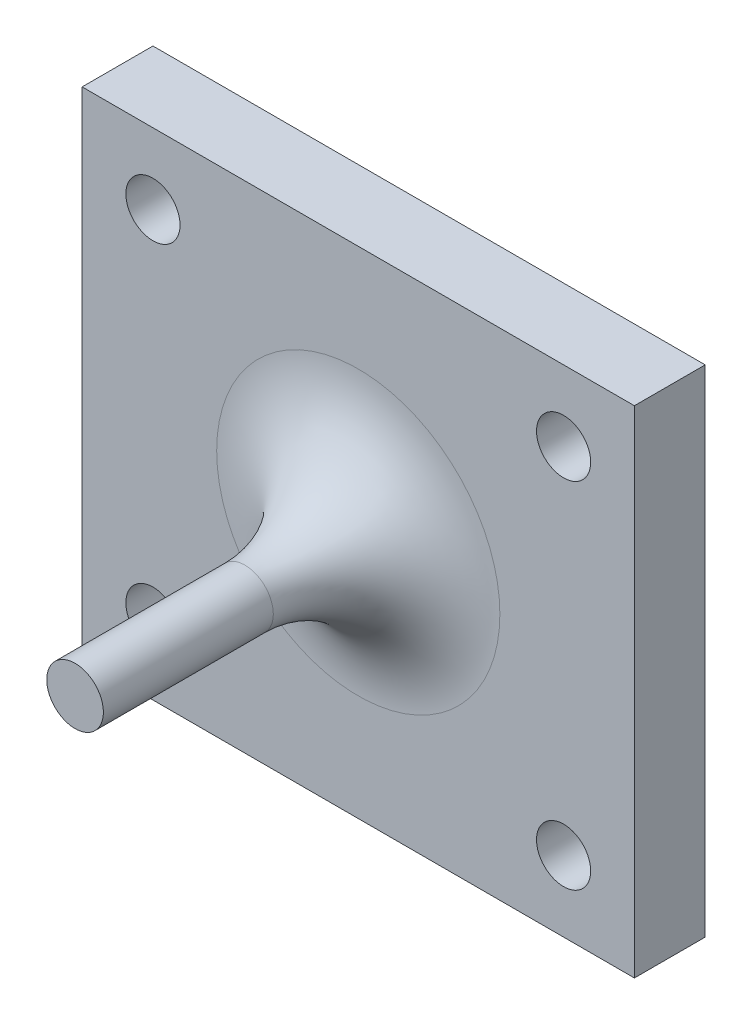
ISO-10303-21;
HEADER;
FILE_DESCRIPTION(('STEP AP214'),'2;1');
FILE_NAME('part.step','',(''),(''),'','','');
FILE_SCHEMA(('AUTOMOTIVE_DESIGN { 1 0 10303 214 1 1 1 1 }'));
ENDSEC;
DATA;
#1=APPLICATION_CONTEXT('core data for automotive mechanical design processes');
#2=APPLICATION_PROTOCOL_DEFINITION('international standard','automotive_design',2000,#1);
#3=PRODUCT_CONTEXT('',#1,'mechanical');
#4=PRODUCT('Part','Part','',(#3));
#5=PRODUCT_RELATED_PRODUCT_CATEGORY('part','',(#4));
#6=PRODUCT_DEFINITION_FORMATION('','',#4);
#7=PRODUCT_DEFINITION_CONTEXT('part definition',#1,'design');
#8=PRODUCT_DEFINITION('design','',#6,#7);
#9=PRODUCT_DEFINITION_SHAPE('','',#8);
#10=(LENGTH_UNIT() NAMED_UNIT(*) SI_UNIT(.MILLI.,.METRE.));
#11=(NAMED_UNIT(*) PLANE_ANGLE_UNIT() SI_UNIT($,.RADIAN.));
#12=(NAMED_UNIT(*) SI_UNIT($,.STERADIAN.) SOLID_ANGLE_UNIT());
#13=UNCERTAINTY_MEASURE_WITH_UNIT(LENGTH_MEASURE(1.E-05),#10,'distance_accuracy_value','');
#14=(GEOMETRIC_REPRESENTATION_CONTEXT(3) GLOBAL_UNCERTAINTY_ASSIGNED_CONTEXT((#13)) GLOBAL_UNIT_ASSIGNED_CONTEXT((#10,
#11,#12)) REPRESENTATION_CONTEXT('',''));
#15=CARTESIAN_POINT('',(0.,0.,0.));
#16=DIRECTION('',(0.,0.,1.));
#17=DIRECTION('',(1.,0.,0.));
#18=AXIS2_PLACEMENT_3D('',#15,#16,#17);
#19=CARTESIAN_POINT('',(0.,0.,5.));
#20=DIRECTION('',(0.,0.,1.));
#21=DIRECTION('',(1.,0.,0.));
#22=AXIS2_PLACEMENT_3D('',#19,#20,#21);
#23=PLANE('',#22);
#24=CARTESIAN_POINT('',(0.,0.,5.));
#25=DIRECTION('',(0.,0.,1.));
#26=DIRECTION('',(1.,0.,0.));
#27=AXIS2_PLACEMENT_3D('',#24,#25,#26);
#28=CIRCLE('',#27,10.);
#29=CARTESIAN_POINT('',(10.,0.,5.));
#30=VERTEX_POINT('',#29);
#31=EDGE_CURVE('E11',#30,#30,#28,.F.);
#32=ORIENTED_EDGE('',*,*,#31,.T.);
#33=EDGE_LOOP('',(#32));
#34=FACE_BOUND('',#33,.T.);
#35=CARTESIAN_POINT('',(-14.5,-12.5,5.));
#36=DIRECTION('',(0.,0.,1.));
#37=DIRECTION('',(1.,0.,0.));
#38=AXIS2_PLACEMENT_3D('',#35,#36,#37);
#39=CIRCLE('',#38,1.91273132209241);
#40=CARTESIAN_POINT('',(-12.5872686779076,-12.5,5.));
#41=VERTEX_POINT('',#40);
#42=EDGE_CURVE('E181',#41,#41,#39,.T.);
#43=ORIENTED_EDGE('',*,*,#42,.F.);
#44=EDGE_LOOP('',(#43));
#45=FACE_BOUND('',#44,.T.);
#46=CARTESIAN_POINT('',(14.5,-12.5,5.));
#47=DIRECTION('',(0.,0.,1.));
#48=DIRECTION('',(1.,0.,0.));
#49=AXIS2_PLACEMENT_3D('',#46,#47,#48);
#50=CIRCLE('',#49,1.91273132209241);
#51=CARTESIAN_POINT('',(16.4127313220924,-12.5,5.));
#52=VERTEX_POINT('',#51);
#53=EDGE_CURVE('E109',#52,#52,#50,.T.);
#54=ORIENTED_EDGE('',*,*,#53,.F.);
#55=EDGE_LOOP('',(#54));
#56=FACE_BOUND('',#55,.T.);
#57=DIRECTION('',(0.,-1.,0.));
#58=VECTOR('',#57,1.);
#59=CARTESIAN_POINT('',(-19.5,17.5,5.));
#60=LINE('',#59,#58);
#61=CARTESIAN_POINT('',(-19.5,17.5,5.));
#62=VERTEX_POINT('',#61);
#63=CARTESIAN_POINT('',(-19.5,-17.5,5.));
#64=VERTEX_POINT('',#63);
#65=EDGE_CURVE('E95',#62,#64,#60,.T.);
#66=ORIENTED_EDGE('',*,*,#65,.T.);
#67=DIRECTION('',(1.,0.,0.));
#68=VECTOR('',#67,1.);
#69=CARTESIAN_POINT('',(-19.5,-17.5,5.));
#70=LINE('',#69,#68);
#71=CARTESIAN_POINT('',(19.5,-17.5,5.));
#72=VERTEX_POINT('',#71);
#73=EDGE_CURVE('E87',#64,#72,#70,.T.);
#74=ORIENTED_EDGE('',*,*,#73,.T.);
#75=DIRECTION('',(0.,1.,0.));
#76=VECTOR('',#75,1.);
#77=CARTESIAN_POINT('',(19.5,17.5,5.));
#78=LINE('',#77,#76);
#79=CARTESIAN_POINT('',(19.5,17.5,5.));
#80=VERTEX_POINT('',#79);
#81=EDGE_CURVE('E89',#72,#80,#78,.T.);
#82=ORIENTED_EDGE('',*,*,#81,.T.);
#83=DIRECTION('',(-1.,0.,0.));
#84=VECTOR('',#83,1.);
#85=CARTESIAN_POINT('',(-19.5,17.5,5.));
#86=LINE('',#85,#84);
#87=EDGE_CURVE('E57',#80,#62,#86,.T.);
#88=ORIENTED_EDGE('',*,*,#87,.T.);
#89=EDGE_LOOP('',(#66,#74,#82,#88));
#90=FACE_BOUND('',#89,.T.);
#91=CARTESIAN_POINT('',(14.5,12.5,5.));
#92=DIRECTION('',(0.,0.,1.));
#93=DIRECTION('',(1.,0.,0.));
#94=AXIS2_PLACEMENT_3D('',#91,#92,#93);
#95=CIRCLE('',#94,1.91273132209241);
#96=CARTESIAN_POINT('',(16.4127313220924,12.5,5.));
#97=VERTEX_POINT('',#96);
#98=EDGE_CURVE('E189',#97,#97,#95,.T.);
#99=ORIENTED_EDGE('',*,*,#98,.F.);
#100=EDGE_LOOP('',(#99));
#101=FACE_BOUND('',#100,.T.);
#102=CARTESIAN_POINT('',(-14.5,12.5,5.));
#103=DIRECTION('',(0.,0.,1.));
#104=DIRECTION('',(1.,0.,0.));
#105=AXIS2_PLACEMENT_3D('',#102,#103,#104);
#106=CIRCLE('',#105,1.91273132209241);
#107=CARTESIAN_POINT('',(-12.5872686779076,12.5,5.));
#108=VERTEX_POINT('',#107);
#109=EDGE_CURVE('E171',#108,#108,#106,.T.);
#110=ORIENTED_EDGE('',*,*,#109,.F.);
#111=EDGE_LOOP('',(#110));
#112=FACE_BOUND('',#111,.T.);
#113=ADVANCED_FACE('F39',(#34,#45,#56,#90,#101,#112),#23,.T.);
#114=CARTESIAN_POINT('',(0.,0.,0.));
#115=DIRECTION('',(0.,0.,1.));
#116=DIRECTION('',(1.,0.,0.));
#117=AXIS2_PLACEMENT_3D('',#114,#115,#116);
#118=PLANE('',#117);
#119=DIRECTION('',(0.,-1.,0.));
#120=VECTOR('',#119,1.);
#121=CARTESIAN_POINT('',(-19.5,17.5,0.));
#122=LINE('',#121,#120);
#123=CARTESIAN_POINT('',(-19.5,17.5,0.));
#124=VERTEX_POINT('',#123);
#125=CARTESIAN_POINT('',(-19.5,-17.5,0.));
#126=VERTEX_POINT('',#125);
#127=EDGE_CURVE('E110',#124,#126,#122,.T.);
#128=ORIENTED_EDGE('',*,*,#127,.F.);
#129=DIRECTION('',(-1.,0.,0.));
#130=VECTOR('',#129,1.);
#131=CARTESIAN_POINT('',(-19.5,17.5,0.));
#132=LINE('',#131,#130);
#133=CARTESIAN_POINT('',(19.5,17.5,0.));
#134=VERTEX_POINT('',#133);
#135=EDGE_CURVE('E80',#134,#124,#132,.T.);
#136=ORIENTED_EDGE('',*,*,#135,.F.);
#137=DIRECTION('',(0.,1.,0.));
#138=VECTOR('',#137,1.);
#139=CARTESIAN_POINT('',(19.5,17.5,0.));
#140=LINE('',#139,#138);
#141=CARTESIAN_POINT('',(19.5,-17.5,0.));
#142=VERTEX_POINT('',#141);
#143=EDGE_CURVE('E71',#142,#134,#140,.T.);
#144=ORIENTED_EDGE('',*,*,#143,.F.);
#145=DIRECTION('',(1.,0.,0.));
#146=VECTOR('',#145,1.);
#147=CARTESIAN_POINT('',(-19.5,-17.5,0.));
#148=LINE('',#147,#146);
#149=EDGE_CURVE('E100',#126,#142,#148,.T.);
#150=ORIENTED_EDGE('',*,*,#149,.F.);
#151=EDGE_LOOP('',(#128,#136,#144,#150));
#152=FACE_BOUND('',#151,.T.);
#153=CARTESIAN_POINT('',(14.5,-12.5,0.));
#154=DIRECTION('',(0.,0.,1.));
#155=DIRECTION('',(1.,0.,0.));
#156=AXIS2_PLACEMENT_3D('',#153,#154,#155);
#157=CIRCLE('',#156,1.91273132209241);
#158=CARTESIAN_POINT('',(16.4127313220924,-12.5,0.));
#159=VERTEX_POINT('',#158);
#160=EDGE_CURVE('E165',#159,#159,#157,.T.);
#161=ORIENTED_EDGE('',*,*,#160,.T.);
#162=EDGE_LOOP('',(#161));
#163=FACE_BOUND('',#162,.T.);
#164=CARTESIAN_POINT('',(14.5,12.5,0.));
#165=DIRECTION('',(0.,0.,1.));
#166=DIRECTION('',(1.,0.,0.));
#167=AXIS2_PLACEMENT_3D('',#164,#165,#166);
#168=CIRCLE('',#167,1.91273132209241);
#169=CARTESIAN_POINT('',(16.4127313220924,12.5,0.));
#170=VERTEX_POINT('',#169);
#171=EDGE_CURVE('E167',#170,#170,#168,.T.);
#172=ORIENTED_EDGE('',*,*,#171,.T.);
#173=EDGE_LOOP('',(#172));
#174=FACE_BOUND('',#173,.T.);
#175=CARTESIAN_POINT('',(-14.5,-12.5,0.));
#176=DIRECTION('',(0.,0.,1.));
#177=DIRECTION('',(1.,0.,0.));
#178=AXIS2_PLACEMENT_3D('',#175,#176,#177);
#179=CIRCLE('',#178,1.91273132209241);
#180=CARTESIAN_POINT('',(-12.5872686779076,-12.5,0.));
#181=VERTEX_POINT('',#180);
#182=EDGE_CURVE('E168',#181,#181,#179,.T.);
#183=ORIENTED_EDGE('',*,*,#182,.T.);
#184=EDGE_LOOP('',(#183));
#185=FACE_BOUND('',#184,.T.);
#186=CARTESIAN_POINT('',(-14.5,12.5,0.));
#187=DIRECTION('',(0.,0.,1.));
#188=DIRECTION('',(1.,0.,0.));
#189=AXIS2_PLACEMENT_3D('',#186,#187,#188);
#190=CIRCLE('',#189,1.91273132209241);
#191=CARTESIAN_POINT('',(-12.5872686779076,12.5,0.));
#192=VERTEX_POINT('',#191);
#193=EDGE_CURVE('E172',#192,#192,#190,.T.);
#194=ORIENTED_EDGE('',*,*,#193,.T.);
#195=EDGE_LOOP('',(#194));
#196=FACE_BOUND('',#195,.T.);
#197=ADVANCED_FACE('F132',(#152,#163,#174,#185,#196),#118,.F.);
#198=CARTESIAN_POINT('',(-19.5,17.5,5.));
#199=DIRECTION('',(1.,0.,0.));
#200=DIRECTION('',(0.,1.,0.));
#201=AXIS2_PLACEMENT_3D('',#198,#199,#200);
#202=PLANE('',#201);
#203=ORIENTED_EDGE('',*,*,#127,.T.);
#204=DIRECTION('',(0.,0.,-1.));
#205=VECTOR('',#204,1.);
#206=CARTESIAN_POINT('',(-19.5,-17.5,5.));
#207=LINE('',#206,#205);
#208=EDGE_CURVE('E98',#64,#126,#207,.T.);
#209=ORIENTED_EDGE('',*,*,#208,.F.);
#210=ORIENTED_EDGE('',*,*,#65,.F.);
#211=DIRECTION('',(0.,0.,-1.));
#212=VECTOR('',#211,1.);
#213=CARTESIAN_POINT('',(-19.5,17.5,5.));
#214=LINE('',#213,#212);
#215=EDGE_CURVE('E103',#62,#124,#214,.T.);
#216=ORIENTED_EDGE('',*,*,#215,.T.);
#217=EDGE_LOOP('',(#203,#209,#210,#216));
#218=FACE_BOUND('',#217,.T.);
#219=ADVANCED_FACE('F138',(#218),#202,.F.);
#220=CARTESIAN_POINT('',(-19.5,-17.5,5.));
#221=DIRECTION('',(0.,1.,0.));
#222=DIRECTION('',(0.,0.,1.));
#223=AXIS2_PLACEMENT_3D('',#220,#221,#222);
#224=PLANE('',#223);
#225=ORIENTED_EDGE('',*,*,#149,.T.);
#226=DIRECTION('',(0.,0.,-1.));
#227=VECTOR('',#226,1.);
#228=CARTESIAN_POINT('',(19.5,-17.5,5.));
#229=LINE('',#228,#227);
#230=EDGE_CURVE('E92',#72,#142,#229,.T.);
#231=ORIENTED_EDGE('',*,*,#230,.F.);
#232=ORIENTED_EDGE('',*,*,#73,.F.);
#233=ORIENTED_EDGE('',*,*,#208,.T.);
#234=EDGE_LOOP('',(#225,#231,#232,#233));
#235=FACE_BOUND('',#234,.T.);
#236=ADVANCED_FACE('F96',(#235),#224,.F.);
#237=CARTESIAN_POINT('',(19.5,17.5,5.));
#238=DIRECTION('',(-1.,0.,0.));
#239=DIRECTION('',(0.,-1.,0.));
#240=AXIS2_PLACEMENT_3D('',#237,#238,#239);
#241=PLANE('',#240);
#242=ORIENTED_EDGE('',*,*,#143,.T.);
#243=DIRECTION('',(0.,0.,-1.));
#244=VECTOR('',#243,1.);
#245=CARTESIAN_POINT('',(19.5,17.5,5.));
#246=LINE('',#245,#244);
#247=EDGE_CURVE('E97',#80,#134,#246,.T.);
#248=ORIENTED_EDGE('',*,*,#247,.F.);
#249=ORIENTED_EDGE('',*,*,#81,.F.);
#250=ORIENTED_EDGE('',*,*,#230,.T.);
#251=EDGE_LOOP('',(#242,#248,#249,#250));
#252=FACE_BOUND('',#251,.T.);
#253=ADVANCED_FACE('F101',(#252),#241,.F.);
#254=CARTESIAN_POINT('',(-19.5,17.5,5.));
#255=DIRECTION('',(0.,-1.,0.));
#256=DIRECTION('',(0.,0.,-1.));
#257=AXIS2_PLACEMENT_3D('',#254,#255,#256);
#258=PLANE('',#257);
#259=ORIENTED_EDGE('',*,*,#135,.T.);
#260=ORIENTED_EDGE('',*,*,#215,.F.);
#261=ORIENTED_EDGE('',*,*,#87,.F.);
#262=ORIENTED_EDGE('',*,*,#247,.T.);
#263=EDGE_LOOP('',(#259,#260,#261,#262));
#264=FACE_BOUND('',#263,.T.);
#265=ADVANCED_FACE('F150',(#264),#258,.F.);
#266=CARTESIAN_POINT('',(14.5,-12.5,5.));
#267=DIRECTION('',(0.,0.,-1.));
#268=DIRECTION('',(-1.,0.,0.));
#269=AXIS2_PLACEMENT_3D('',#266,#267,#268);
#270=CYLINDRICAL_SURFACE('',#269,1.91273132209241);
#271=ORIENTED_EDGE('',*,*,#53,.T.);
#272=EDGE_LOOP('',(#271));
#273=FACE_BOUND('',#272,.T.);
#274=ORIENTED_EDGE('',*,*,#160,.F.);
#275=EDGE_LOOP('',(#274));
#276=FACE_BOUND('',#275,.T.);
#277=ADVANCED_FACE('F145',(#273,#276),#270,.F.);
#278=CARTESIAN_POINT('',(14.5,12.5,5.));
#279=DIRECTION('',(0.,0.,-1.));
#280=DIRECTION('',(-1.,0.,0.));
#281=AXIS2_PLACEMENT_3D('',#278,#279,#280);
#282=CYLINDRICAL_SURFACE('',#281,1.91273132209241);
#283=ORIENTED_EDGE('',*,*,#98,.T.);
#284=EDGE_LOOP('',(#283));
#285=FACE_BOUND('',#284,.T.);
#286=ORIENTED_EDGE('',*,*,#171,.F.);
#287=EDGE_LOOP('',(#286));
#288=FACE_BOUND('',#287,.T.);
#289=ADVANCED_FACE('F196',(#285,#288),#282,.F.);
#290=CARTESIAN_POINT('',(-14.5,-12.5,5.));
#291=DIRECTION('',(0.,0.,-1.));
#292=DIRECTION('',(-1.,0.,0.));
#293=AXIS2_PLACEMENT_3D('',#290,#291,#292);
#294=CYLINDRICAL_SURFACE('',#293,1.91273132209241);
#295=ORIENTED_EDGE('',*,*,#42,.T.);
#296=EDGE_LOOP('',(#295));
#297=FACE_BOUND('',#296,.T.);
#298=ORIENTED_EDGE('',*,*,#182,.F.);
#299=EDGE_LOOP('',(#298));
#300=FACE_BOUND('',#299,.T.);
#301=ADVANCED_FACE('F205',(#297,#300),#294,.F.);
#302=CARTESIAN_POINT('',(-14.5,12.5,5.));
#303=DIRECTION('',(0.,0.,-1.));
#304=DIRECTION('',(-1.,0.,0.));
#305=AXIS2_PLACEMENT_3D('',#302,#303,#304);
#306=CYLINDRICAL_SURFACE('',#305,1.91273132209241);
#307=ORIENTED_EDGE('',*,*,#109,.T.);
#308=EDGE_LOOP('',(#307));
#309=FACE_BOUND('',#308,.T.);
#310=ORIENTED_EDGE('',*,*,#193,.F.);
#311=EDGE_LOOP('',(#310));
#312=FACE_BOUND('',#311,.T.);
#313=ADVANCED_FACE('F210',(#309,#312),#306,.F.);
#314=CARTESIAN_POINT('',(0.,0.,25.));
#315=DIRECTION('',(0.,0.,-1.));
#316=DIRECTION('',(-1.,0.,0.));
#317=AXIS2_PLACEMENT_3D('',#314,#315,#316);
#318=CYLINDRICAL_SURFACE('',#317,2.);
#319=CARTESIAN_POINT('',(0.,0.,13.));
#320=DIRECTION('',(0.,0.,1.));
#321=DIRECTION('',(1.,0.,0.));
#322=AXIS2_PLACEMENT_3D('',#319,#320,#321);
#323=CIRCLE('',#322,2.);
#324=CARTESIAN_POINT('',(2.,0.,13.));
#325=VERTEX_POINT('',#324);
#326=EDGE_CURVE('E48',#325,#325,#323,.T.);
#327=ORIENTED_EDGE('',*,*,#326,.T.);
#328=EDGE_LOOP('',(#327));
#329=FACE_BOUND('',#328,.T.);
#330=CARTESIAN_POINT('',(0.,0.,25.));
#331=DIRECTION('',(0.,0.,1.));
#332=DIRECTION('',(1.,0.,0.));
#333=AXIS2_PLACEMENT_3D('',#330,#331,#332);
#334=CIRCLE('',#333,2.);
#335=CARTESIAN_POINT('',(2.,0.,25.));
#336=VERTEX_POINT('',#335);
#337=EDGE_CURVE('E176',#336,#336,#334,.T.);
#338=ORIENTED_EDGE('',*,*,#337,.F.);
#339=EDGE_LOOP('',(#338));
#340=FACE_BOUND('',#339,.T.);
#341=ADVANCED_FACE('F120',(#329,#340),#318,.T.);
#342=CARTESIAN_POINT('',(0.,0.,25.));
#343=DIRECTION('',(0.,0.,1.));
#344=DIRECTION('',(1.,0.,0.));
#345=AXIS2_PLACEMENT_3D('',#342,#343,#344);
#346=PLANE('',#345);
#347=ORIENTED_EDGE('',*,*,#337,.T.);
#348=EDGE_LOOP('',(#347));
#349=FACE_BOUND('',#348,.T.);
#350=ADVANCED_FACE('F122',(#349),#346,.T.);
#351=CARTESIAN_POINT('',(0.,0.,13.));
#352=DIRECTION('',(0.,0.,1.));
#353=DIRECTION('',(1.,0.,0.));
#354=AXIS2_PLACEMENT_3D('',#351,#352,#353);
#355=TOROIDAL_SURFACE('',#354,10.,8.);
#356=ORIENTED_EDGE('',*,*,#31,.F.);
#357=EDGE_LOOP('',(#356));
#358=FACE_BOUND('',#357,.T.);
#359=ORIENTED_EDGE('',*,*,#326,.F.);
#360=EDGE_LOOP('',(#359));
#361=FACE_BOUND('',#360,.T.);
#362=ADVANCED_FACE('F41',(#358,#361),#355,.F.);
#363=CLOSED_SHELL('',(#113,#197,#219,#236,#253,#265,#277,#289,#301,#313,#341,#350,#362));
#364=MANIFOLD_SOLID_BREP('B2',#363);
#365=ADVANCED_BREP_SHAPE_REPRESENTATION('',(#18,#364),#14);
#366=SHAPE_DEFINITION_REPRESENTATION(#9,#365);
ENDSEC;
END-ISO-10303-21;
